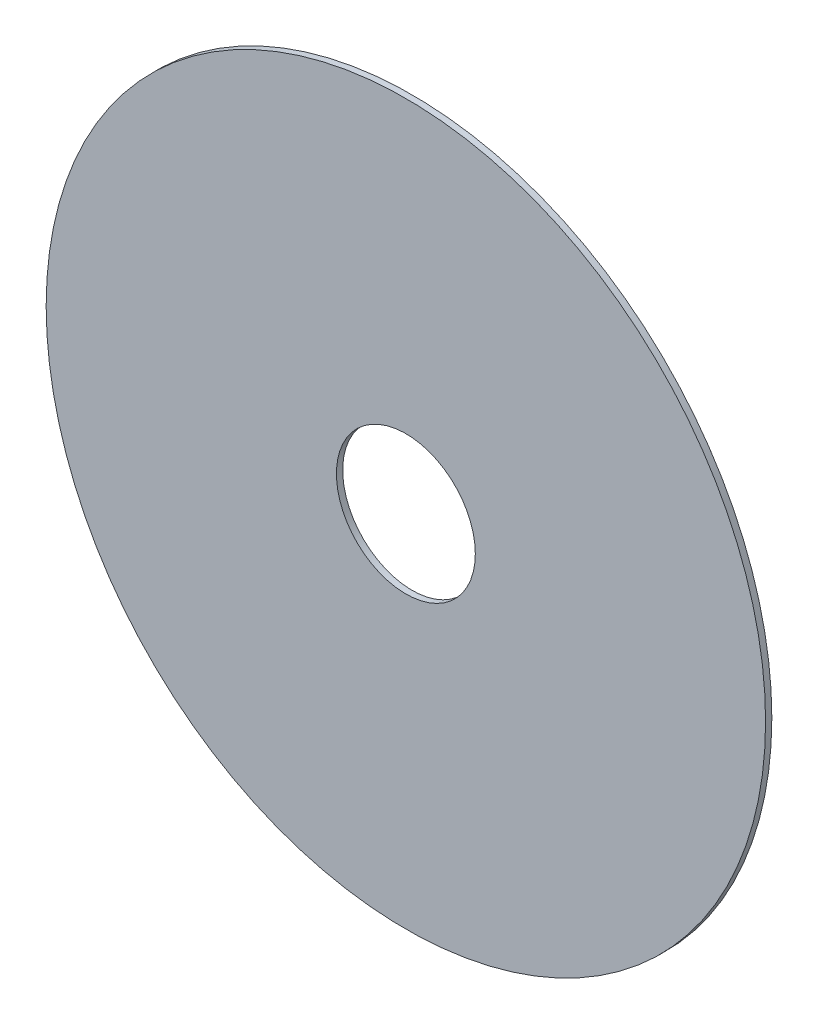
ISO-10303-21;
HEADER;
FILE_DESCRIPTION(('STEP AP214'),'2;1');
FILE_NAME('part.step','',(''),(''),'','','');
FILE_SCHEMA(('AUTOMOTIVE_DESIGN { 1 0 10303 214 1 1 1 1 }'));
ENDSEC;
DATA;
#1=APPLICATION_CONTEXT('core data for automotive mechanical design processes');
#2=APPLICATION_PROTOCOL_DEFINITION('international standard','automotive_design',2000,#1);
#3=PRODUCT_CONTEXT('',#1,'mechanical');
#4=PRODUCT('Part','Part','',(#3));
#5=PRODUCT_RELATED_PRODUCT_CATEGORY('part','',(#4));
#6=PRODUCT_DEFINITION_FORMATION('','',#4);
#7=PRODUCT_DEFINITION_CONTEXT('part definition',#1,'design');
#8=PRODUCT_DEFINITION('design','',#6,#7);
#9=PRODUCT_DEFINITION_SHAPE('','',#8);
#10=(LENGTH_UNIT() NAMED_UNIT(*) SI_UNIT(.MILLI.,.METRE.));
#11=(NAMED_UNIT(*) PLANE_ANGLE_UNIT() SI_UNIT($,.RADIAN.));
#12=(NAMED_UNIT(*) SI_UNIT($,.STERADIAN.) SOLID_ANGLE_UNIT());
#13=UNCERTAINTY_MEASURE_WITH_UNIT(LENGTH_MEASURE(1.E-05),#10,'distance_accuracy_value','');
#14=(GEOMETRIC_REPRESENTATION_CONTEXT(3) GLOBAL_UNCERTAINTY_ASSIGNED_CONTEXT((#13)) GLOBAL_UNIT_ASSIGNED_CONTEXT((#10,
#11,#12)) REPRESENTATION_CONTEXT('',''));
#15=CARTESIAN_POINT('',(0.,0.,0.));
#16=DIRECTION('',(0.,0.,1.));
#17=DIRECTION('',(1.,0.,0.));
#18=AXIS2_PLACEMENT_3D('',#15,#16,#17);
#19=CARTESIAN_POINT('',(0.,0.,1.));
#20=DIRECTION('',(0.,0.,1.));
#21=DIRECTION('',(1.,0.,0.));
#22=AXIS2_PLACEMENT_3D('',#19,#20,#21);
#23=PLANE('',#22);
#24=CARTESIAN_POINT('',(0.,0.,1.));
#25=DIRECTION('',(0.,0.,1.));
#26=DIRECTION('',(1.,0.,0.));
#27=AXIS2_PLACEMENT_3D('',#24,#25,#26);
#28=CIRCLE('',#27,57.5);
#29=CARTESIAN_POINT('',(57.5,0.,1.));
#30=VERTEX_POINT('',#29);
#31=EDGE_CURVE('E12',#30,#30,#28,.T.);
#32=ORIENTED_EDGE('',*,*,#31,.T.);
#33=EDGE_LOOP('',(#32));
#34=FACE_BOUND('',#33,.T.);
#35=CARTESIAN_POINT('',(0.,0.,1.));
#36=DIRECTION('',(0.,0.,1.));
#37=DIRECTION('',(1.,0.,0.));
#38=AXIS2_PLACEMENT_3D('',#35,#36,#37);
#39=CIRCLE('',#38,11.1);
#40=CARTESIAN_POINT('',(11.1,0.,1.));
#41=VERTEX_POINT('',#40);
#42=EDGE_CURVE('E53',#41,#41,#39,.T.);
#43=ORIENTED_EDGE('',*,*,#42,.F.);
#44=EDGE_LOOP('',(#43));
#45=FACE_BOUND('',#44,.T.);
#46=ADVANCED_FACE('F42',(#34,#45),#23,.T.);
#47=CARTESIAN_POINT('',(0.,0.,0.));
#48=DIRECTION('',(0.,0.,1.));
#49=DIRECTION('',(1.,0.,0.));
#50=AXIS2_PLACEMENT_3D('',#47,#48,#49);
#51=PLANE('',#50);
#52=CARTESIAN_POINT('',(0.,0.,0.));
#53=DIRECTION('',(0.,0.,1.));
#54=DIRECTION('',(1.,0.,0.));
#55=AXIS2_PLACEMENT_3D('',#52,#53,#54);
#56=CIRCLE('',#55,57.5);
#57=CARTESIAN_POINT('',(57.5,0.,0.));
#58=VERTEX_POINT('',#57);
#59=EDGE_CURVE('E46',#58,#58,#56,.T.);
#60=ORIENTED_EDGE('',*,*,#59,.F.);
#61=EDGE_LOOP('',(#60));
#62=FACE_BOUND('',#61,.T.);
#63=CARTESIAN_POINT('',(0.,0.,0.));
#64=DIRECTION('',(0.,0.,1.));
#65=DIRECTION('',(1.,0.,0.));
#66=AXIS2_PLACEMENT_3D('',#63,#64,#65);
#67=CIRCLE('',#66,11.1);
#68=CARTESIAN_POINT('',(11.1,0.,0.));
#69=VERTEX_POINT('',#68);
#70=EDGE_CURVE('E55',#69,#69,#67,.T.);
#71=ORIENTED_EDGE('',*,*,#70,.T.);
#72=EDGE_LOOP('',(#71));
#73=FACE_BOUND('',#72,.T.);
#74=ADVANCED_FACE('F65',(#62,#73),#51,.F.);
#75=CARTESIAN_POINT('',(0.,0.,1.));
#76=DIRECTION('',(0.,0.,-1.));
#77=DIRECTION('',(-1.,0.,0.));
#78=AXIS2_PLACEMENT_3D('',#75,#76,#77);
#79=CYLINDRICAL_SURFACE('',#78,57.5);
#80=ORIENTED_EDGE('',*,*,#31,.F.);
#81=EDGE_LOOP('',(#80));
#82=FACE_BOUND('',#81,.T.);
#83=ORIENTED_EDGE('',*,*,#59,.T.);
#84=EDGE_LOOP('',(#83));
#85=FACE_BOUND('',#84,.T.);
#86=ADVANCED_FACE('F44',(#82,#85),#79,.T.);
#87=CARTESIAN_POINT('',(0.,0.,1.));
#88=DIRECTION('',(0.,0.,-1.));
#89=DIRECTION('',(-1.,0.,0.));
#90=AXIS2_PLACEMENT_3D('',#87,#88,#89);
#91=CYLINDRICAL_SURFACE('',#90,11.1);
#92=ORIENTED_EDGE('',*,*,#42,.T.);
#93=EDGE_LOOP('',(#92));
#94=FACE_BOUND('',#93,.T.);
#95=ORIENTED_EDGE('',*,*,#70,.F.);
#96=EDGE_LOOP('',(#95));
#97=FACE_BOUND('',#96,.T.);
#98=ADVANCED_FACE('F61',(#94,#97),#91,.F.);
#99=CLOSED_SHELL('',(#46,#74,#86,#98));
#100=MANIFOLD_SOLID_BREP('B2',#99);
#101=ADVANCED_BREP_SHAPE_REPRESENTATION('',(#18,#100),#14);
#102=SHAPE_DEFINITION_REPRESENTATION(#9,#101);
ENDSEC;
END-ISO-10303-21;
